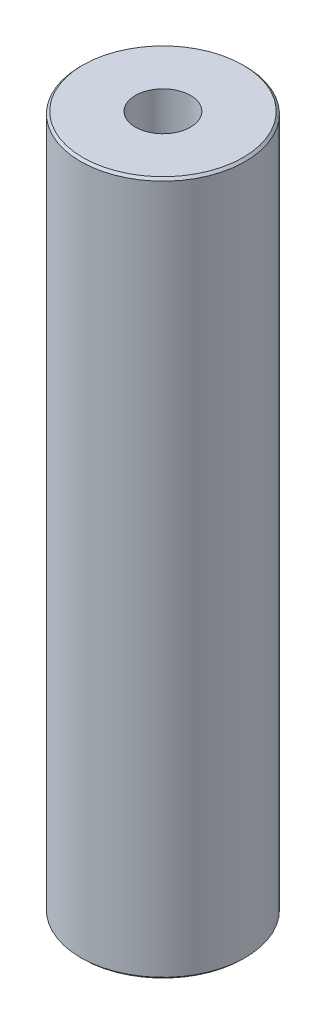
ISO-10303-21;
HEADER;
FILE_DESCRIPTION(('STEP AP214'),'2;1');
FILE_NAME('part.step','',(''),(''),'','','');
FILE_SCHEMA(('AUTOMOTIVE_DESIGN { 1 0 10303 214 1 1 1 1 }'));
ENDSEC;
DATA;
#1=APPLICATION_CONTEXT('core data for automotive mechanical design processes');
#2=APPLICATION_PROTOCOL_DEFINITION('international standard','automotive_design',2000,#1);
#3=PRODUCT_CONTEXT('',#1,'mechanical');
#4=PRODUCT('Part','Part','',(#3));
#5=PRODUCT_RELATED_PRODUCT_CATEGORY('part','',(#4));
#6=PRODUCT_DEFINITION_FORMATION('','',#4);
#7=PRODUCT_DEFINITION_CONTEXT('part definition',#1,'design');
#8=PRODUCT_DEFINITION('design','',#6,#7);
#9=PRODUCT_DEFINITION_SHAPE('','',#8);
#10=(LENGTH_UNIT() NAMED_UNIT(*) SI_UNIT(.MILLI.,.METRE.));
#11=(NAMED_UNIT(*) PLANE_ANGLE_UNIT() SI_UNIT($,.RADIAN.));
#12=(NAMED_UNIT(*) SI_UNIT($,.STERADIAN.) SOLID_ANGLE_UNIT());
#13=UNCERTAINTY_MEASURE_WITH_UNIT(LENGTH_MEASURE(1.E-05),#10,'distance_accuracy_value','');
#14=(GEOMETRIC_REPRESENTATION_CONTEXT(3) GLOBAL_UNCERTAINTY_ASSIGNED_CONTEXT((#13)) GLOBAL_UNIT_ASSIGNED_CONTEXT((#10,
#11,#12)) REPRESENTATION_CONTEXT('',''));
#15=CARTESIAN_POINT('',(0.,0.,0.));
#16=DIRECTION('',(0.,0.,1.));
#17=DIRECTION('',(1.,0.,0.));
#18=AXIS2_PLACEMENT_3D('',#15,#16,#17);
#19=CARTESIAN_POINT('',(0.,463.253957147995,0.));
#20=DIRECTION('',(0.,-1.,0.));
#21=DIRECTION('',(0.,0.,-1.));
#22=AXIS2_PLACEMENT_3D('',#19,#20,#21);
#23=CYLINDRICAL_SURFACE('',#22,55.);
#24=CARTESIAN_POINT('',(0.,461.733055912274,0.));
#25=DIRECTION('',(0.,1.,0.));
#26=DIRECTION('',(0.,0.,1.));
#27=AXIS2_PLACEMENT_3D('',#24,#25,#26);
#28=CIRCLE('',#27,55.);
#29=CARTESIAN_POINT('',(0.,461.733055912274,55.));
#30=VERTEX_POINT('',#29);
#31=EDGE_CURVE('E50',#30,#30,#28,.F.);
#32=ORIENTED_EDGE('',*,*,#31,.T.);
#33=EDGE_LOOP('',(#32));
#34=FACE_BOUND('',#33,.T.);
#35=CARTESIAN_POINT('',(0.,1.52090123572018,0.));
#36=DIRECTION('',(0.,1.,0.));
#37=DIRECTION('',(0.,0.,1.));
#38=AXIS2_PLACEMENT_3D('',#35,#36,#37);
#39=CIRCLE('',#38,55.);
#40=CARTESIAN_POINT('',(0.,1.52090123572018,55.));
#41=VERTEX_POINT('',#40);
#42=EDGE_CURVE('E51',#41,#41,#39,.T.);
#43=ORIENTED_EDGE('',*,*,#42,.T.);
#44=EDGE_LOOP('',(#43));
#45=FACE_BOUND('',#44,.T.);
#46=ADVANCED_FACE('F39',(#34,#45),#23,.T.);
#47=CARTESIAN_POINT('',(0.,463.253957147995,0.));
#48=DIRECTION('',(0.,1.,0.));
#49=DIRECTION('',(0.,0.,1.));
#50=AXIS2_PLACEMENT_3D('',#47,#48,#49);
#51=PLANE('',#50);
#52=CARTESIAN_POINT('',(0.,463.253957147995,0.));
#53=DIRECTION('',(0.,1.,0.));
#54=DIRECTION('',(0.,0.,1.));
#55=AXIS2_PLACEMENT_3D('',#52,#53,#54);
#56=CIRCLE('',#55,53.4790987642797);
#57=CARTESIAN_POINT('',(0.,463.253957147995,53.4790987642797));
#58=VERTEX_POINT('',#57);
#59=EDGE_CURVE('E54',#58,#58,#56,.T.);
#60=ORIENTED_EDGE('',*,*,#59,.T.);
#61=EDGE_LOOP('',(#60));
#62=FACE_BOUND('',#61,.T.);
#63=CARTESIAN_POINT('',(0.,463.253957147995,0.));
#64=DIRECTION('',(0.,1.,0.));
#65=DIRECTION('',(0.,0.,1.));
#66=AXIS2_PLACEMENT_3D('',#63,#64,#65);
#67=CIRCLE('',#66,18.3854565277008);
#68=CARTESIAN_POINT('',(0.,463.253957147995,18.3854565277008));
#69=VERTEX_POINT('',#68);
#70=EDGE_CURVE('E58',#69,#69,#67,.T.);
#71=ORIENTED_EDGE('',*,*,#70,.F.);
#72=EDGE_LOOP('',(#71));
#73=FACE_BOUND('',#72,.T.);
#74=ADVANCED_FACE('F69',(#62,#73),#51,.T.);
#75=CARTESIAN_POINT('',(0.,0.,0.));
#76=DIRECTION('',(0.,1.,0.));
#77=DIRECTION('',(0.,0.,1.));
#78=AXIS2_PLACEMENT_3D('',#75,#76,#77);
#79=PLANE('',#78);
#80=CARTESIAN_POINT('',(0.,0.,0.));
#81=DIRECTION('',(0.,1.,0.));
#82=DIRECTION('',(0.,0.,1.));
#83=AXIS2_PLACEMENT_3D('',#80,#81,#82);
#84=CIRCLE('',#83,53.4790987642798);
#85=CARTESIAN_POINT('',(0.,0.,53.4790987642798));
#86=VERTEX_POINT('',#85);
#87=EDGE_CURVE('E10',#86,#86,#84,.F.);
#88=ORIENTED_EDGE('',*,*,#87,.T.);
#89=EDGE_LOOP('',(#88));
#90=FACE_BOUND('',#89,.T.);
#91=CARTESIAN_POINT('',(0.,0.,0.));
#92=DIRECTION('',(0.,1.,0.));
#93=DIRECTION('',(0.,0.,1.));
#94=AXIS2_PLACEMENT_3D('',#91,#92,#93);
#95=CIRCLE('',#94,18.3854565277008);
#96=CARTESIAN_POINT('',(0.,0.,18.3854565277008));
#97=VERTEX_POINT('',#96);
#98=EDGE_CURVE('E63',#97,#97,#95,.T.);
#99=ORIENTED_EDGE('',*,*,#98,.T.);
#100=EDGE_LOOP('',(#99));
#101=FACE_BOUND('',#100,.T.);
#102=ADVANCED_FACE('F75',(#90,#101),#79,.F.);
#103=CARTESIAN_POINT('',(0.,463.253957147995,0.));
#104=DIRECTION('',(0.,-1.,0.));
#105=DIRECTION('',(0.,0.,-1.));
#106=AXIS2_PLACEMENT_3D('',#103,#104,#105);
#107=CYLINDRICAL_SURFACE('',#106,18.3854565277008);
#108=ORIENTED_EDGE('',*,*,#70,.T.);
#109=EDGE_LOOP('',(#108));
#110=FACE_BOUND('',#109,.T.);
#111=ORIENTED_EDGE('',*,*,#98,.F.);
#112=EDGE_LOOP('',(#111));
#113=FACE_BOUND('',#112,.T.);
#114=ADVANCED_FACE('F70',(#110,#113),#107,.F.);
#115=CARTESIAN_POINT('',(0.,463.253957147995,0.));
#116=DIRECTION('',(0.,-1.,0.));
#117=DIRECTION('',(0.,0.,-1.));
#118=AXIS2_PLACEMENT_3D('',#115,#116,#117);
#119=CONICAL_SURFACE('',#118,53.4790987642797,0.785398163397469);
#120=ORIENTED_EDGE('',*,*,#31,.F.);
#121=EDGE_LOOP('',(#120));
#122=FACE_BOUND('',#121,.T.);
#123=ORIENTED_EDGE('',*,*,#59,.F.);
#124=EDGE_LOOP('',(#123));
#125=FACE_BOUND('',#124,.T.);
#126=ADVANCED_FACE('F81',(#122,#125),#119,.T.);
#127=CARTESIAN_POINT('',(0.,1.52090123572018,0.));
#128=DIRECTION('',(0.,1.,0.));
#129=DIRECTION('',(0.,0.,1.));
#130=AXIS2_PLACEMENT_3D('',#127,#128,#129);
#131=CONICAL_SURFACE('',#130,55.,0.785398163397451);
#132=ORIENTED_EDGE('',*,*,#87,.F.);
#133=EDGE_LOOP('',(#132));
#134=FACE_BOUND('',#133,.T.);
#135=ORIENTED_EDGE('',*,*,#42,.F.);
#136=EDGE_LOOP('',(#135));
#137=FACE_BOUND('',#136,.T.);
#138=ADVANCED_FACE('F45',(#134,#137),#131,.T.);
#139=CLOSED_SHELL('',(#46,#74,#102,#114,#126,#138));
#140=MANIFOLD_SOLID_BREP('B2',#139);
#141=ADVANCED_BREP_SHAPE_REPRESENTATION('',(#18,#140),#14);
#142=SHAPE_DEFINITION_REPRESENTATION(#9,#141);
ENDSEC;
END-ISO-10303-21;
